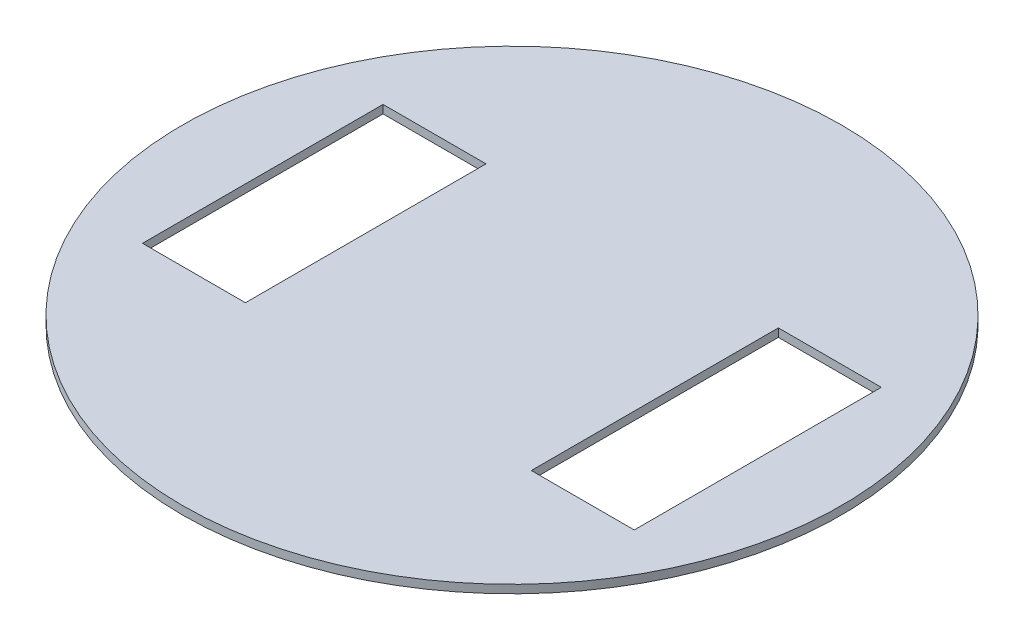
ISO-10303-21;
HEADER;
FILE_DESCRIPTION(('STEP AP214'),'2;1');
FILE_NAME('part.step','',(''),(''),'','','');
FILE_SCHEMA(('AUTOMOTIVE_DESIGN { 1 0 10303 214 1 1 1 1 }'));
ENDSEC;
DATA;
#1=APPLICATION_CONTEXT('core data for automotive mechanical design processes');
#2=APPLICATION_PROTOCOL_DEFINITION('international standard','automotive_design',2000,#1);
#3=PRODUCT_CONTEXT('',#1,'mechanical');
#4=PRODUCT('Part','Part','',(#3));
#5=PRODUCT_RELATED_PRODUCT_CATEGORY('part','',(#4));
#6=PRODUCT_DEFINITION_FORMATION('','',#4);
#7=PRODUCT_DEFINITION_CONTEXT('part definition',#1,'design');
#8=PRODUCT_DEFINITION('design','',#6,#7);
#9=PRODUCT_DEFINITION_SHAPE('','',#8);
#10=(LENGTH_UNIT() NAMED_UNIT(*) SI_UNIT(.MILLI.,.METRE.));
#11=(NAMED_UNIT(*) PLANE_ANGLE_UNIT() SI_UNIT($,.RADIAN.));
#12=(NAMED_UNIT(*) SI_UNIT($,.STERADIAN.) SOLID_ANGLE_UNIT());
#13=UNCERTAINTY_MEASURE_WITH_UNIT(LENGTH_MEASURE(1.E-05),#10,'distance_accuracy_value','');
#14=(GEOMETRIC_REPRESENTATION_CONTEXT(3) GLOBAL_UNCERTAINTY_ASSIGNED_CONTEXT((#13)) GLOBAL_UNIT_ASSIGNED_CONTEXT((#10,
#11,#12)) REPRESENTATION_CONTEXT('',''));
#15=CARTESIAN_POINT('',(0.,0.,0.));
#16=DIRECTION('',(0.,0.,1.));
#17=DIRECTION('',(1.,0.,0.));
#18=AXIS2_PLACEMENT_3D('',#15,#16,#17);
#19=CARTESIAN_POINT('',(0.,2.54,0.));
#20=DIRECTION('',(0.,1.,0.));
#21=DIRECTION('',(0.,0.,1.));
#22=AXIS2_PLACEMENT_3D('',#19,#20,#21);
#23=PLANE('',#22);
#24=CARTESIAN_POINT('',(0.,2.54,0.));
#25=DIRECTION('',(0.,1.,0.));
#26=DIRECTION('',(0.,0.,1.));
#27=AXIS2_PLACEMENT_3D('',#24,#25,#26);
#28=CIRCLE('',#27,101.639987753181);
#29=CARTESIAN_POINT('',(0.,2.54,101.639987753181));
#30=VERTEX_POINT('',#29);
#31=EDGE_CURVE('E11',#30,#30,#28,.T.);
#32=ORIENTED_EDGE('',*,*,#31,.T.);
#33=EDGE_LOOP('',(#32));
#34=FACE_BOUND('',#33,.T.);
#35=DIRECTION('',(-1.,0.,0.));
#36=VECTOR('',#35,1.);
#37=CARTESIAN_POINT('',(-76.2,2.54,-36.4276765722748));
#38=LINE('',#37,#36);
#39=CARTESIAN_POINT('',(-44.45,2.54,-36.4276765722748));
#40=VERTEX_POINT('',#39);
#41=CARTESIAN_POINT('',(-76.2,2.54,-36.4276765722748));
#42=VERTEX_POINT('',#41);
#43=EDGE_CURVE('E140',#40,#42,#38,.T.);
#44=ORIENTED_EDGE('',*,*,#43,.F.);
#45=DIRECTION('',(0.,0.,-1.));
#46=VECTOR('',#45,1.);
#47=CARTESIAN_POINT('',(-44.45,2.54,-36.4276765722748));
#48=LINE('',#47,#46);
#49=CARTESIAN_POINT('',(-44.45,2.54,37.7669416900868));
#50=VERTEX_POINT('',#49);
#51=EDGE_CURVE('E138',#50,#40,#48,.T.);
#52=ORIENTED_EDGE('',*,*,#51,.F.);
#53=DIRECTION('',(1.,0.,0.));
#54=VECTOR('',#53,1.);
#55=CARTESIAN_POINT('',(-76.2,2.54,37.7669416900868));
#56=LINE('',#55,#54);
#57=CARTESIAN_POINT('',(-76.2,2.54,37.7669416900868));
#58=VERTEX_POINT('',#57);
#59=EDGE_CURVE('E146',#58,#50,#56,.T.);
#60=ORIENTED_EDGE('',*,*,#59,.F.);
#61=DIRECTION('',(0.,0.,1.));
#62=VECTOR('',#61,1.);
#63=CARTESIAN_POINT('',(-76.2,2.54,-36.4276765722748));
#64=LINE('',#63,#62);
#65=EDGE_CURVE('E143',#42,#58,#64,.T.);
#66=ORIENTED_EDGE('',*,*,#65,.F.);
#67=EDGE_LOOP('',(#44,#52,#60,#66));
#68=FACE_BOUND('',#67,.T.);
#69=DIRECTION('',(1.,0.,0.));
#70=VECTOR('',#69,1.);
#71=CARTESIAN_POINT('',(76.2,2.54,38.5017795353435));
#72=LINE('',#71,#70);
#73=CARTESIAN_POINT('',(44.45,2.54,38.5017795353435));
#74=VERTEX_POINT('',#73);
#75=CARTESIAN_POINT('',(76.2,2.54,38.5017795353435));
#76=VERTEX_POINT('',#75);
#77=EDGE_CURVE('E110',#74,#76,#72,.T.);
#78=ORIENTED_EDGE('',*,*,#77,.F.);
#79=DIRECTION('',(0.,0.,1.));
#80=VECTOR('',#79,1.);
#81=CARTESIAN_POINT('',(44.45,2.54,38.5017795353435));
#82=LINE('',#81,#80);
#83=CARTESIAN_POINT('',(44.45,2.54,-37.6982204646565));
#84=VERTEX_POINT('',#83);
#85=EDGE_CURVE('E102',#84,#74,#82,.T.);
#86=ORIENTED_EDGE('',*,*,#85,.F.);
#87=DIRECTION('',(-1.,0.,0.));
#88=VECTOR('',#87,1.);
#89=CARTESIAN_POINT('',(76.2,2.54,-37.6982204646565));
#90=LINE('',#89,#88);
#91=CARTESIAN_POINT('',(76.2,2.54,-37.6982204646565));
#92=VERTEX_POINT('',#91);
#93=EDGE_CURVE('E124',#92,#84,#90,.T.);
#94=ORIENTED_EDGE('',*,*,#93,.F.);
#95=DIRECTION('',(0.,0.,-1.));
#96=VECTOR('',#95,1.);
#97=CARTESIAN_POINT('',(76.2,2.54,38.5017795353435));
#98=LINE('',#97,#96);
#99=EDGE_CURVE('E122',#76,#92,#98,.T.);
#100=ORIENTED_EDGE('',*,*,#99,.F.);
#101=EDGE_LOOP('',(#78,#86,#94,#100));
#102=FACE_BOUND('',#101,.T.);
#103=ADVANCED_FACE('F37',(#34,#68,#102),#23,.T.);
#104=CARTESIAN_POINT('',(0.,0.,0.));
#105=DIRECTION('',(0.,1.,0.));
#106=DIRECTION('',(0.,0.,1.));
#107=AXIS2_PLACEMENT_3D('',#104,#105,#106);
#108=PLANE('',#107);
#109=DIRECTION('',(0.,0.,-1.));
#110=VECTOR('',#109,1.);
#111=CARTESIAN_POINT('',(-44.45,0.,-36.4276765722748));
#112=LINE('',#111,#110);
#113=CARTESIAN_POINT('',(-44.45,0.,37.7669416900868));
#114=VERTEX_POINT('',#113);
#115=CARTESIAN_POINT('',(-44.45,0.,-36.4276765722748));
#116=VERTEX_POINT('',#115);
#117=EDGE_CURVE('E118',#114,#116,#112,.T.);
#118=ORIENTED_EDGE('',*,*,#117,.T.);
#119=DIRECTION('',(-1.,0.,0.));
#120=VECTOR('',#119,1.);
#121=CARTESIAN_POINT('',(-76.2,0.,-36.4276765722748));
#122=LINE('',#121,#120);
#123=CARTESIAN_POINT('',(-76.2,0.,-36.4276765722748));
#124=VERTEX_POINT('',#123);
#125=EDGE_CURVE('E151',#116,#124,#122,.T.);
#126=ORIENTED_EDGE('',*,*,#125,.T.);
#127=DIRECTION('',(0.,0.,1.));
#128=VECTOR('',#127,1.);
#129=CARTESIAN_POINT('',(-76.2,0.,-36.4276765722748));
#130=LINE('',#129,#128);
#131=CARTESIAN_POINT('',(-76.2,0.,37.7669416900868));
#132=VERTEX_POINT('',#131);
#133=EDGE_CURVE('E154',#124,#132,#130,.T.);
#134=ORIENTED_EDGE('',*,*,#133,.T.);
#135=DIRECTION('',(1.,0.,0.));
#136=VECTOR('',#135,1.);
#137=CARTESIAN_POINT('',(-76.2,0.,37.7669416900868));
#138=LINE('',#137,#136);
#139=EDGE_CURVE('E141',#132,#114,#138,.T.);
#140=ORIENTED_EDGE('',*,*,#139,.T.);
#141=EDGE_LOOP('',(#118,#126,#134,#140));
#142=FACE_BOUND('',#141,.T.);
#143=CARTESIAN_POINT('',(0.,0.,0.));
#144=DIRECTION('',(0.,1.,0.));
#145=DIRECTION('',(0.,0.,1.));
#146=AXIS2_PLACEMENT_3D('',#143,#144,#145);
#147=CIRCLE('',#146,101.639987753181);
#148=CARTESIAN_POINT('',(0.,0.,101.639987753181));
#149=VERTEX_POINT('',#148);
#150=EDGE_CURVE('E41',#149,#149,#147,.T.);
#151=ORIENTED_EDGE('',*,*,#150,.F.);
#152=EDGE_LOOP('',(#151));
#153=FACE_BOUND('',#152,.T.);
#154=DIRECTION('',(0.,0.,1.));
#155=VECTOR('',#154,1.);
#156=CARTESIAN_POINT('',(44.45,0.,38.5017795353435));
#157=LINE('',#156,#155);
#158=CARTESIAN_POINT('',(44.45,0.,-37.6982204646565));
#159=VERTEX_POINT('',#158);
#160=CARTESIAN_POINT('',(44.45,0.,38.5017795353435));
#161=VERTEX_POINT('',#160);
#162=EDGE_CURVE('E60',#159,#161,#157,.T.);
#163=ORIENTED_EDGE('',*,*,#162,.T.);
#164=DIRECTION('',(1.,0.,0.));
#165=VECTOR('',#164,1.);
#166=CARTESIAN_POINT('',(76.2,0.,38.5017795353435));
#167=LINE('',#166,#165);
#168=CARTESIAN_POINT('',(76.2,0.,38.5017795353435));
#169=VERTEX_POINT('',#168);
#170=EDGE_CURVE('E117',#161,#169,#167,.T.);
#171=ORIENTED_EDGE('',*,*,#170,.T.);
#172=DIRECTION('',(0.,0.,-1.));
#173=VECTOR('',#172,1.);
#174=CARTESIAN_POINT('',(76.2,0.,38.5017795353435));
#175=LINE('',#174,#173);
#176=CARTESIAN_POINT('',(76.2,0.,-37.6982204646565));
#177=VERTEX_POINT('',#176);
#178=EDGE_CURVE('E130',#169,#177,#175,.T.);
#179=ORIENTED_EDGE('',*,*,#178,.T.);
#180=DIRECTION('',(-1.,0.,0.));
#181=VECTOR('',#180,1.);
#182=CARTESIAN_POINT('',(76.2,0.,-37.6982204646565));
#183=LINE('',#182,#181);
#184=EDGE_CURVE('E111',#177,#159,#183,.T.);
#185=ORIENTED_EDGE('',*,*,#184,.T.);
#186=EDGE_LOOP('',(#163,#171,#179,#185));
#187=FACE_BOUND('',#186,.T.);
#188=ADVANCED_FACE('F173',(#142,#153,#187),#108,.F.);
#189=CARTESIAN_POINT('',(0.,2.54,0.));
#190=DIRECTION('',(0.,-1.,0.));
#191=DIRECTION('',(0.,0.,-1.));
#192=AXIS2_PLACEMENT_3D('',#189,#190,#191);
#193=CYLINDRICAL_SURFACE('',#192,101.639987753181);
#194=ORIENTED_EDGE('',*,*,#31,.F.);
#195=EDGE_LOOP('',(#194));
#196=FACE_BOUND('',#195,.T.);
#197=ORIENTED_EDGE('',*,*,#150,.T.);
#198=EDGE_LOOP('',(#197));
#199=FACE_BOUND('',#198,.T.);
#200=ADVANCED_FACE('F39',(#196,#199),#193,.T.);
#201=CARTESIAN_POINT('',(-44.45,2.54,-36.4276765722748));
#202=DIRECTION('',(-1.,0.,0.));
#203=DIRECTION('',(0.,0.,1.));
#204=AXIS2_PLACEMENT_3D('',#201,#202,#203);
#205=PLANE('',#204);
#206=ORIENTED_EDGE('',*,*,#117,.F.);
#207=DIRECTION('',(0.,-1.,0.));
#208=VECTOR('',#207,1.);
#209=CARTESIAN_POINT('',(-44.45,2.54,37.7669416900868));
#210=LINE('',#209,#208);
#211=EDGE_CURVE('E148',#50,#114,#210,.T.);
#212=ORIENTED_EDGE('',*,*,#211,.F.);
#213=ORIENTED_EDGE('',*,*,#51,.T.);
#214=DIRECTION('',(0.,-1.,0.));
#215=VECTOR('',#214,1.);
#216=CARTESIAN_POINT('',(-44.45,2.54,-36.4276765722748));
#217=LINE('',#216,#215);
#218=EDGE_CURVE('E165',#40,#116,#217,.T.);
#219=ORIENTED_EDGE('',*,*,#218,.T.);
#220=EDGE_LOOP('',(#206,#212,#213,#219));
#221=FACE_BOUND('',#220,.T.);
#222=ADVANCED_FACE('F194',(#221),#205,.T.);
#223=CARTESIAN_POINT('',(-76.2,2.54,-36.4276765722748));
#224=DIRECTION('',(0.,0.,1.));
#225=DIRECTION('',(1.,0.,0.));
#226=AXIS2_PLACEMENT_3D('',#223,#224,#225);
#227=PLANE('',#226);
#228=ORIENTED_EDGE('',*,*,#125,.F.);
#229=ORIENTED_EDGE('',*,*,#218,.F.);
#230=ORIENTED_EDGE('',*,*,#43,.T.);
#231=DIRECTION('',(0.,-1.,0.));
#232=VECTOR('',#231,1.);
#233=CARTESIAN_POINT('',(-76.2,2.54,-36.4276765722748));
#234=LINE('',#233,#232);
#235=EDGE_CURVE('E163',#42,#124,#234,.T.);
#236=ORIENTED_EDGE('',*,*,#235,.T.);
#237=EDGE_LOOP('',(#228,#229,#230,#236));
#238=FACE_BOUND('',#237,.T.);
#239=ADVANCED_FACE('F197',(#238),#227,.T.);
#240=CARTESIAN_POINT('',(-76.2,2.54,-36.4276765722748));
#241=DIRECTION('',(1.,0.,0.));
#242=DIRECTION('',(0.,0.,-1.));
#243=AXIS2_PLACEMENT_3D('',#240,#241,#242);
#244=PLANE('',#243);
#245=ORIENTED_EDGE('',*,*,#133,.F.);
#246=ORIENTED_EDGE('',*,*,#235,.F.);
#247=ORIENTED_EDGE('',*,*,#65,.T.);
#248=DIRECTION('',(0.,-1.,0.));
#249=VECTOR('',#248,1.);
#250=CARTESIAN_POINT('',(-76.2,2.54,37.7669416900868));
#251=LINE('',#250,#249);
#252=EDGE_CURVE('E161',#58,#132,#251,.T.);
#253=ORIENTED_EDGE('',*,*,#252,.T.);
#254=EDGE_LOOP('',(#245,#246,#247,#253));
#255=FACE_BOUND('',#254,.T.);
#256=ADVANCED_FACE('F200',(#255),#244,.T.);
#257=CARTESIAN_POINT('',(-76.2,2.54,37.7669416900868));
#258=DIRECTION('',(0.,0.,-1.));
#259=DIRECTION('',(-1.,0.,0.));
#260=AXIS2_PLACEMENT_3D('',#257,#258,#259);
#261=PLANE('',#260);
#262=ORIENTED_EDGE('',*,*,#139,.F.);
#263=ORIENTED_EDGE('',*,*,#252,.F.);
#264=ORIENTED_EDGE('',*,*,#59,.T.);
#265=ORIENTED_EDGE('',*,*,#211,.T.);
#266=EDGE_LOOP('',(#262,#263,#264,#265));
#267=FACE_BOUND('',#266,.T.);
#268=ADVANCED_FACE('F204',(#267),#261,.T.);
#269=CARTESIAN_POINT('',(44.45,2.54,38.5017795353435));
#270=DIRECTION('',(1.,0.,0.));
#271=DIRECTION('',(0.,0.,-1.));
#272=AXIS2_PLACEMENT_3D('',#269,#270,#271);
#273=PLANE('',#272);
#274=ORIENTED_EDGE('',*,*,#162,.F.);
#275=DIRECTION('',(0.,-1.,0.));
#276=VECTOR('',#275,1.);
#277=CARTESIAN_POINT('',(44.45,2.54,-37.6982204646565));
#278=LINE('',#277,#276);
#279=EDGE_CURVE('E106',#84,#159,#278,.T.);
#280=ORIENTED_EDGE('',*,*,#279,.F.);
#281=ORIENTED_EDGE('',*,*,#85,.T.);
#282=DIRECTION('',(0.,-1.,0.));
#283=VECTOR('',#282,1.);
#284=CARTESIAN_POINT('',(44.45,2.54,38.5017795353435));
#285=LINE('',#284,#283);
#286=EDGE_CURVE('E105',#74,#161,#285,.T.);
#287=ORIENTED_EDGE('',*,*,#286,.T.);
#288=EDGE_LOOP('',(#274,#280,#281,#287));
#289=FACE_BOUND('',#288,.T.);
#290=ADVANCED_FACE('F104',(#289),#273,.T.);
#291=CARTESIAN_POINT('',(76.2,2.54,38.5017795353435));
#292=DIRECTION('',(0.,0.,-1.));
#293=DIRECTION('',(-1.,0.,0.));
#294=AXIS2_PLACEMENT_3D('',#291,#292,#293);
#295=PLANE('',#294);
#296=ORIENTED_EDGE('',*,*,#170,.F.);
#297=ORIENTED_EDGE('',*,*,#286,.F.);
#298=ORIENTED_EDGE('',*,*,#77,.T.);
#299=DIRECTION('',(0.,-1.,0.));
#300=VECTOR('',#299,1.);
#301=CARTESIAN_POINT('',(76.2,2.54,38.5017795353435));
#302=LINE('',#301,#300);
#303=EDGE_CURVE('E119',#76,#169,#302,.T.);
#304=ORIENTED_EDGE('',*,*,#303,.T.);
#305=EDGE_LOOP('',(#296,#297,#298,#304));
#306=FACE_BOUND('',#305,.T.);
#307=ADVANCED_FACE('F114',(#306),#295,.T.);
#308=CARTESIAN_POINT('',(76.2,2.54,38.5017795353435));
#309=DIRECTION('',(-1.,0.,0.));
#310=DIRECTION('',(0.,0.,1.));
#311=AXIS2_PLACEMENT_3D('',#308,#309,#310);
#312=PLANE('',#311);
#313=ORIENTED_EDGE('',*,*,#178,.F.);
#314=ORIENTED_EDGE('',*,*,#303,.F.);
#315=ORIENTED_EDGE('',*,*,#99,.T.);
#316=DIRECTION('',(0.,-1.,0.));
#317=VECTOR('',#316,1.);
#318=CARTESIAN_POINT('',(76.2,2.54,-37.6982204646565));
#319=LINE('',#318,#317);
#320=EDGE_CURVE('E52',#92,#177,#319,.T.);
#321=ORIENTED_EDGE('',*,*,#320,.T.);
#322=EDGE_LOOP('',(#313,#314,#315,#321));
#323=FACE_BOUND('',#322,.T.);
#324=ADVANCED_FACE('F180',(#323),#312,.T.);
#325=CARTESIAN_POINT('',(76.2,2.54,-37.6982204646565));
#326=DIRECTION('',(0.,0.,1.));
#327=DIRECTION('',(1.,0.,0.));
#328=AXIS2_PLACEMENT_3D('',#325,#326,#327);
#329=PLANE('',#328);
#330=ORIENTED_EDGE('',*,*,#184,.F.);
#331=ORIENTED_EDGE('',*,*,#320,.F.);
#332=ORIENTED_EDGE('',*,*,#93,.T.);
#333=ORIENTED_EDGE('',*,*,#279,.T.);
#334=EDGE_LOOP('',(#330,#331,#332,#333));
#335=FACE_BOUND('',#334,.T.);
#336=ADVANCED_FACE('F178',(#335),#329,.T.);
#337=CLOSED_SHELL('',(#103,#188,#200,#222,#239,#256,#268,#290,#307,#324,#336));
#338=MANIFOLD_SOLID_BREP('B2',#337);
#339=ADVANCED_BREP_SHAPE_REPRESENTATION('',(#18,#338),#14);
#340=SHAPE_DEFINITION_REPRESENTATION(#9,#339);
ENDSEC;
END-ISO-10303-21;
